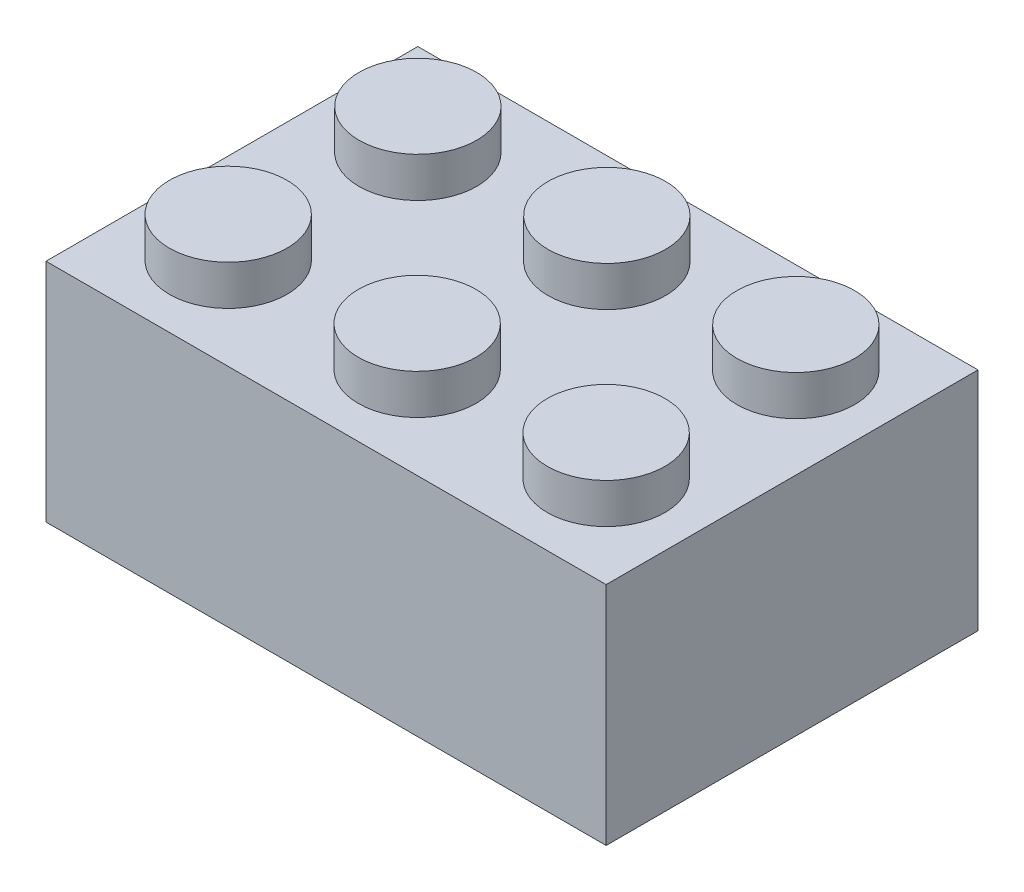
ISO-10303-21;
HEADER;
FILE_DESCRIPTION(('STEP AP214'),'2;1');
FILE_NAME('part.step','',(''),(''),'','','');
FILE_SCHEMA(('AUTOMOTIVE_DESIGN { 1 0 10303 214 1 1 1 1 }'));
ENDSEC;
DATA;
#1=APPLICATION_CONTEXT('core data for automotive mechanical design processes');
#2=APPLICATION_PROTOCOL_DEFINITION('international standard','automotive_design',2000,#1);
#3=PRODUCT_CONTEXT('',#1,'mechanical');
#4=PRODUCT('Part','Part','',(#3));
#5=PRODUCT_RELATED_PRODUCT_CATEGORY('part','',(#4));
#6=PRODUCT_DEFINITION_FORMATION('','',#4);
#7=PRODUCT_DEFINITION_CONTEXT('part definition',#1,'design');
#8=PRODUCT_DEFINITION('design','',#6,#7);
#9=PRODUCT_DEFINITION_SHAPE('','',#8);
#10=(LENGTH_UNIT() NAMED_UNIT(*) SI_UNIT(.MILLI.,.METRE.));
#11=(NAMED_UNIT(*) PLANE_ANGLE_UNIT() SI_UNIT($,.RADIAN.));
#12=(NAMED_UNIT(*) SI_UNIT($,.STERADIAN.) SOLID_ANGLE_UNIT());
#13=UNCERTAINTY_MEASURE_WITH_UNIT(LENGTH_MEASURE(1.E-05),#10,'distance_accuracy_value','');
#14=(GEOMETRIC_REPRESENTATION_CONTEXT(3) GLOBAL_UNCERTAINTY_ASSIGNED_CONTEXT((#13)) GLOBAL_UNIT_ASSIGNED_CONTEXT((#10,
#11,#12)) REPRESENTATION_CONTEXT('',''));
#15=CARTESIAN_POINT('',(0.,0.,0.));
#16=DIRECTION('',(0.,0.,1.));
#17=DIRECTION('',(1.,0.,0.));
#18=AXIS2_PLACEMENT_3D('',#15,#16,#17);
#19=CARTESIAN_POINT('',(0.,9.6,-15.8));
#20=DIRECTION('',(0.,0.,-1.));
#21=DIRECTION('',(-1.,0.,0.));
#22=AXIS2_PLACEMENT_3D('',#19,#20,#21);
#23=PLANE('',#22);
#24=DIRECTION('',(1.,0.,0.));
#25=VECTOR('',#24,1.);
#26=CARTESIAN_POINT('',(0.,0.,-15.8));
#27=LINE('',#26,#25);
#28=CARTESIAN_POINT('',(0.,0.,-15.8));
#29=VERTEX_POINT('',#28);
#30=CARTESIAN_POINT('',(23.8,0.,-15.8));
#31=VERTEX_POINT('',#30);
#32=EDGE_CURVE('E102',#29,#31,#27,.T.);
#33=ORIENTED_EDGE('',*,*,#32,.F.);
#34=DIRECTION('',(0.,-1.,0.));
#35=VECTOR('',#34,1.);
#36=CARTESIAN_POINT('',(0.,9.6,-15.8));
#37=LINE('',#36,#35);
#38=CARTESIAN_POINT('',(0.,9.6,-15.8));
#39=VERTEX_POINT('',#38);
#40=EDGE_CURVE('E11',#39,#29,#37,.T.);
#41=ORIENTED_EDGE('',*,*,#40,.F.);
#42=DIRECTION('',(1.,0.,0.));
#43=VECTOR('',#42,1.);
#44=CARTESIAN_POINT('',(0.,9.6,-15.8));
#45=LINE('',#44,#43);
#46=CARTESIAN_POINT('',(23.8,9.6,-15.8));
#47=VERTEX_POINT('',#46);
#48=EDGE_CURVE('E95',#39,#47,#45,.T.);
#49=ORIENTED_EDGE('',*,*,#48,.T.);
#50=DIRECTION('',(0.,-1.,0.));
#51=VECTOR('',#50,1.);
#52=CARTESIAN_POINT('',(23.8,9.6,-15.8));
#53=LINE('',#52,#51);
#54=EDGE_CURVE('E40',#47,#31,#53,.T.);
#55=ORIENTED_EDGE('',*,*,#54,.T.);
#56=EDGE_LOOP('',(#33,#41,#49,#55));
#57=FACE_BOUND('',#56,.T.);
#58=ADVANCED_FACE('F37',(#57),#23,.T.);
#59=CARTESIAN_POINT('',(0.,9.6,0.));
#60=DIRECTION('',(-1.,0.,0.));
#61=DIRECTION('',(0.,0.,1.));
#62=AXIS2_PLACEMENT_3D('',#59,#60,#61);
#63=PLANE('',#62);
#64=DIRECTION('',(0.,0.,-1.));
#65=VECTOR('',#64,1.);
#66=CARTESIAN_POINT('',(0.,0.,0.));
#67=LINE('',#66,#65);
#68=CARTESIAN_POINT('',(0.,0.,0.));
#69=VERTEX_POINT('',#68);
#70=EDGE_CURVE('E97',#69,#29,#67,.T.);
#71=ORIENTED_EDGE('',*,*,#70,.F.);
#72=DIRECTION('',(0.,-1.,0.));
#73=VECTOR('',#72,1.);
#74=CARTESIAN_POINT('',(0.,9.6,0.));
#75=LINE('',#74,#73);
#76=CARTESIAN_POINT('',(0.,9.6,0.));
#77=VERTEX_POINT('',#76);
#78=EDGE_CURVE('E46',#77,#69,#75,.T.);
#79=ORIENTED_EDGE('',*,*,#78,.F.);
#80=DIRECTION('',(0.,0.,-1.));
#81=VECTOR('',#80,1.);
#82=CARTESIAN_POINT('',(0.,9.6,0.));
#83=LINE('',#82,#81);
#84=EDGE_CURVE('E85',#77,#39,#83,.T.);
#85=ORIENTED_EDGE('',*,*,#84,.T.);
#86=ORIENTED_EDGE('',*,*,#40,.T.);
#87=EDGE_LOOP('',(#71,#79,#85,#86));
#88=FACE_BOUND('',#87,.T.);
#89=ADVANCED_FACE('F113',(#88),#63,.T.);
#90=CARTESIAN_POINT('',(0.,9.6,0.));
#91=DIRECTION('',(0.,0.,-1.));
#92=DIRECTION('',(-1.,0.,0.));
#93=AXIS2_PLACEMENT_3D('',#90,#91,#92);
#94=PLANE('',#93);
#95=DIRECTION('',(1.,0.,0.));
#96=VECTOR('',#95,1.);
#97=CARTESIAN_POINT('',(0.,0.,0.));
#98=LINE('',#97,#96);
#99=CARTESIAN_POINT('',(23.8,0.,0.));
#100=VERTEX_POINT('',#99);
#101=EDGE_CURVE('E90',#69,#100,#98,.T.);
#102=ORIENTED_EDGE('',*,*,#101,.T.);
#103=DIRECTION('',(0.,-1.,0.));
#104=VECTOR('',#103,1.);
#105=CARTESIAN_POINT('',(23.8,9.6,0.));
#106=LINE('',#105,#104);
#107=CARTESIAN_POINT('',(23.8,9.6,0.));
#108=VERTEX_POINT('',#107);
#109=EDGE_CURVE('E88',#108,#100,#106,.T.);
#110=ORIENTED_EDGE('',*,*,#109,.F.);
#111=DIRECTION('',(1.,0.,0.));
#112=VECTOR('',#111,1.);
#113=CARTESIAN_POINT('',(0.,9.6,0.));
#114=LINE('',#113,#112);
#115=EDGE_CURVE('E82',#77,#108,#114,.T.);
#116=ORIENTED_EDGE('',*,*,#115,.F.);
#117=ORIENTED_EDGE('',*,*,#78,.T.);
#118=EDGE_LOOP('',(#102,#110,#116,#117));
#119=FACE_BOUND('',#118,.T.);
#120=ADVANCED_FACE('F89',(#119),#94,.F.);
#121=CARTESIAN_POINT('',(23.8,9.6,0.));
#122=DIRECTION('',(-1.,0.,0.));
#123=DIRECTION('',(0.,0.,1.));
#124=AXIS2_PLACEMENT_3D('',#121,#122,#123);
#125=PLANE('',#124);
#126=DIRECTION('',(0.,0.,-1.));
#127=VECTOR('',#126,1.);
#128=CARTESIAN_POINT('',(23.8,0.,0.));
#129=LINE('',#128,#127);
#130=EDGE_CURVE('E105',#100,#31,#129,.T.);
#131=ORIENTED_EDGE('',*,*,#130,.T.);
#132=ORIENTED_EDGE('',*,*,#54,.F.);
#133=DIRECTION('',(0.,0.,-1.));
#134=VECTOR('',#133,1.);
#135=CARTESIAN_POINT('',(23.8,9.6,0.));
#136=LINE('',#135,#134);
#137=EDGE_CURVE('E79',#108,#47,#136,.T.);
#138=ORIENTED_EDGE('',*,*,#137,.F.);
#139=ORIENTED_EDGE('',*,*,#109,.T.);
#140=EDGE_LOOP('',(#131,#132,#138,#139));
#141=FACE_BOUND('',#140,.T.);
#142=ADVANCED_FACE('F94',(#141),#125,.F.);
#143=CARTESIAN_POINT('',(0.,9.6,0.));
#144=DIRECTION('',(0.,1.,0.));
#145=DIRECTION('',(0.,0.,1.));
#146=AXIS2_PLACEMENT_3D('',#143,#144,#145);
#147=PLANE('',#146);
#148=CARTESIAN_POINT('',(3.841707201316,9.6,-3.9));
#149=DIRECTION('',(0.,1.,0.));
#150=DIRECTION('',(0.,0.,1.));
#151=AXIS2_PLACEMENT_3D('',#148,#149,#150);
#152=CIRCLE('',#151,2.5);
#153=CARTESIAN_POINT('',(3.841707201316,9.6,-1.4));
#154=VERTEX_POINT('',#153);
#155=EDGE_CURVE('E269',#154,#154,#152,.T.);
#156=ORIENTED_EDGE('',*,*,#155,.F.);
#157=EDGE_LOOP('',(#156));
#158=FACE_BOUND('',#157,.T.);
#159=CARTESIAN_POINT('',(19.9000000000001,9.6,-3.9));
#160=DIRECTION('',(0.,1.,0.));
#161=DIRECTION('',(0.,0.,1.));
#162=AXIS2_PLACEMENT_3D('',#159,#160,#161);
#163=CIRCLE('',#162,2.5);
#164=CARTESIAN_POINT('',(19.9000000000001,9.6,-1.4));
#165=VERTEX_POINT('',#164);
#166=EDGE_CURVE('E274',#165,#165,#163,.T.);
#167=ORIENTED_EDGE('',*,*,#166,.F.);
#168=EDGE_LOOP('',(#167));
#169=FACE_BOUND('',#168,.T.);
#170=CARTESIAN_POINT('',(11.870853600658,9.6,-3.9));
#171=DIRECTION('',(0.,1.,0.));
#172=DIRECTION('',(0.,0.,1.));
#173=AXIS2_PLACEMENT_3D('',#170,#171,#172);
#174=CIRCLE('',#173,2.5);
#175=CARTESIAN_POINT('',(11.870853600658,9.6,-1.4));
#176=VERTEX_POINT('',#175);
#177=EDGE_CURVE('E280',#176,#176,#174,.T.);
#178=ORIENTED_EDGE('',*,*,#177,.F.);
#179=EDGE_LOOP('',(#178));
#180=FACE_BOUND('',#179,.T.);
#181=CARTESIAN_POINT('',(19.9582927986841,9.6,-11.9));
#182=DIRECTION('',(0.,1.,0.));
#183=DIRECTION('',(0.,0.,1.));
#184=AXIS2_PLACEMENT_3D('',#181,#182,#183);
#185=CIRCLE('',#184,2.5);
#186=CARTESIAN_POINT('',(19.9582927986841,9.6,-9.4));
#187=VERTEX_POINT('',#186);
#188=EDGE_CURVE('E286',#187,#187,#185,.T.);
#189=ORIENTED_EDGE('',*,*,#188,.F.);
#190=EDGE_LOOP('',(#189));
#191=FACE_BOUND('',#190,.T.);
#192=CARTESIAN_POINT('',(11.929146399342,9.6,-11.9));
#193=DIRECTION('',(0.,1.,0.));
#194=DIRECTION('',(0.,0.,1.));
#195=AXIS2_PLACEMENT_3D('',#192,#193,#194);
#196=CIRCLE('',#195,2.5);
#197=CARTESIAN_POINT('',(11.929146399342,9.6,-9.4));
#198=VERTEX_POINT('',#197);
#199=EDGE_CURVE('E292',#198,#198,#196,.T.);
#200=ORIENTED_EDGE('',*,*,#199,.F.);
#201=EDGE_LOOP('',(#200));
#202=FACE_BOUND('',#201,.T.);
#203=CARTESIAN_POINT('',(3.9,9.6,-11.9));
#204=DIRECTION('',(0.,1.,0.));
#205=DIRECTION('',(0.,0.,1.));
#206=AXIS2_PLACEMENT_3D('',#203,#204,#205);
#207=CIRCLE('',#206,2.5);
#208=CARTESIAN_POINT('',(3.9,9.6,-9.4));
#209=VERTEX_POINT('',#208);
#210=EDGE_CURVE('E298',#209,#209,#207,.T.);
#211=ORIENTED_EDGE('',*,*,#210,.F.);
#212=EDGE_LOOP('',(#211));
#213=FACE_BOUND('',#212,.T.);
#214=ORIENTED_EDGE('',*,*,#48,.F.);
#215=ORIENTED_EDGE('',*,*,#84,.F.);
#216=ORIENTED_EDGE('',*,*,#115,.T.);
#217=ORIENTED_EDGE('',*,*,#137,.T.);
#218=EDGE_LOOP('',(#214,#215,#216,#217));
#219=FACE_BOUND('',#218,.T.);
#220=ADVANCED_FACE('F84',(#158,#169,#180,#191,#202,#213,#219),#147,.T.);
#221=CARTESIAN_POINT('',(0.,0.,0.));
#222=DIRECTION('',(0.,1.,0.));
#223=DIRECTION('',(0.,0.,1.));
#224=AXIS2_PLACEMENT_3D('',#221,#222,#223);
#225=PLANE('',#224);
#226=CARTESIAN_POINT('',(3.90000000000008,0.,-11.9));
#227=DIRECTION('',(0.,-1.,0.));
#228=DIRECTION('',(0.,0.,-1.));
#229=AXIS2_PLACEMENT_3D('',#226,#227,#228);
#230=CIRCLE('',#229,2.6);
#231=CARTESIAN_POINT('',(3.90000000000008,0.,-14.5));
#232=VERTEX_POINT('',#231);
#233=EDGE_CURVE('E265',#232,#232,#230,.T.);
#234=ORIENTED_EDGE('',*,*,#233,.F.);
#235=EDGE_LOOP('',(#234));
#236=FACE_BOUND('',#235,.T.);
#237=CARTESIAN_POINT('',(19.9000000000001,0.,-11.9));
#238=DIRECTION('',(0.,-1.,0.));
#239=DIRECTION('',(0.,0.,-1.));
#240=AXIS2_PLACEMENT_3D('',#237,#238,#239);
#241=CIRCLE('',#240,2.6);
#242=CARTESIAN_POINT('',(19.9000000000001,0.,-14.5));
#243=VERTEX_POINT('',#242);
#244=EDGE_CURVE('E259',#243,#243,#241,.T.);
#245=ORIENTED_EDGE('',*,*,#244,.F.);
#246=EDGE_LOOP('',(#245));
#247=FACE_BOUND('',#246,.T.);
#248=CARTESIAN_POINT('',(11.9000000000001,0.,-11.9));
#249=DIRECTION('',(0.,-1.,0.));
#250=DIRECTION('',(0.,0.,-1.));
#251=AXIS2_PLACEMENT_3D('',#248,#249,#250);
#252=CIRCLE('',#251,2.6);
#253=CARTESIAN_POINT('',(11.9000000000001,0.,-14.5));
#254=VERTEX_POINT('',#253);
#255=EDGE_CURVE('E253',#254,#254,#252,.T.);
#256=ORIENTED_EDGE('',*,*,#255,.F.);
#257=EDGE_LOOP('',(#256));
#258=FACE_BOUND('',#257,.T.);
#259=CARTESIAN_POINT('',(19.9,0.,-3.9));
#260=DIRECTION('',(0.,-1.,0.));
#261=DIRECTION('',(0.,0.,-1.));
#262=AXIS2_PLACEMENT_3D('',#259,#260,#261);
#263=CIRCLE('',#262,2.6);
#264=CARTESIAN_POINT('',(19.9,0.,-6.5));
#265=VERTEX_POINT('',#264);
#266=EDGE_CURVE('E247',#265,#265,#263,.T.);
#267=ORIENTED_EDGE('',*,*,#266,.F.);
#268=EDGE_LOOP('',(#267));
#269=FACE_BOUND('',#268,.T.);
#270=CARTESIAN_POINT('',(11.9,0.,-3.9));
#271=DIRECTION('',(0.,-1.,0.));
#272=DIRECTION('',(0.,0.,-1.));
#273=AXIS2_PLACEMENT_3D('',#270,#271,#272);
#274=CIRCLE('',#273,2.6);
#275=CARTESIAN_POINT('',(11.9,0.,-6.5));
#276=VERTEX_POINT('',#275);
#277=EDGE_CURVE('E236',#276,#276,#274,.T.);
#278=ORIENTED_EDGE('',*,*,#277,.F.);
#279=EDGE_LOOP('',(#278));
#280=FACE_BOUND('',#279,.T.);
#281=CARTESIAN_POINT('',(3.9,0.,-3.9));
#282=DIRECTION('',(0.,-1.,0.));
#283=DIRECTION('',(0.,0.,-1.));
#284=AXIS2_PLACEMENT_3D('',#281,#282,#283);
#285=CIRCLE('',#284,2.6);
#286=CARTESIAN_POINT('',(3.9,0.,-6.5));
#287=VERTEX_POINT('',#286);
#288=EDGE_CURVE('E235',#287,#287,#285,.T.);
#289=ORIENTED_EDGE('',*,*,#288,.F.);
#290=EDGE_LOOP('',(#289));
#291=FACE_BOUND('',#290,.T.);
#292=ORIENTED_EDGE('',*,*,#32,.T.);
#293=ORIENTED_EDGE('',*,*,#130,.F.);
#294=ORIENTED_EDGE('',*,*,#101,.F.);
#295=ORIENTED_EDGE('',*,*,#70,.T.);
#296=EDGE_LOOP('',(#292,#293,#294,#295));
#297=FACE_BOUND('',#296,.T.);
#298=ADVANCED_FACE('F112',(#236,#247,#258,#269,#280,#291,#297),#225,.F.);
#299=CARTESIAN_POINT('',(3.9,11.3,-11.9));
#300=DIRECTION('',(0.,-1.,0.));
#301=DIRECTION('',(0.,0.,-1.));
#302=AXIS2_PLACEMENT_3D('',#299,#300,#301);
#303=CYLINDRICAL_SURFACE('',#302,2.5);
#304=CARTESIAN_POINT('',(3.9,11.3,-11.9));
#305=DIRECTION('',(0.,1.,0.));
#306=DIRECTION('',(0.,0.,1.));
#307=AXIS2_PLACEMENT_3D('',#304,#305,#306);
#308=CIRCLE('',#307,2.5);
#309=CARTESIAN_POINT('',(3.9,11.3,-9.4));
#310=VERTEX_POINT('',#309);
#311=EDGE_CURVE('E106',#310,#310,#308,.T.);
#312=ORIENTED_EDGE('',*,*,#311,.F.);
#313=EDGE_LOOP('',(#312));
#314=FACE_BOUND('',#313,.T.);
#315=ORIENTED_EDGE('',*,*,#210,.T.);
#316=EDGE_LOOP('',(#315));
#317=FACE_BOUND('',#316,.T.);
#318=ADVANCED_FACE('F131',(#314,#317),#303,.T.);
#319=CARTESIAN_POINT('',(3.9,11.3,-11.9));
#320=DIRECTION('',(0.,1.,0.));
#321=DIRECTION('',(0.,0.,1.));
#322=AXIS2_PLACEMENT_3D('',#319,#320,#321);
#323=PLANE('',#322);
#324=ORIENTED_EDGE('',*,*,#311,.T.);
#325=EDGE_LOOP('',(#324));
#326=FACE_BOUND('',#325,.T.);
#327=ADVANCED_FACE('F138',(#326),#323,.T.);
#328=CARTESIAN_POINT('',(11.929146399342,11.3,-11.9));
#329=DIRECTION('',(0.,-1.,0.));
#330=DIRECTION('',(0.,0.,-1.));
#331=AXIS2_PLACEMENT_3D('',#328,#329,#330);
#332=CYLINDRICAL_SURFACE('',#331,2.5);
#333=CARTESIAN_POINT('',(11.929146399342,11.3,-11.9));
#334=DIRECTION('',(0.,1.,0.));
#335=DIRECTION('',(0.,0.,1.));
#336=AXIS2_PLACEMENT_3D('',#333,#334,#335);
#337=CIRCLE('',#336,2.5);
#338=CARTESIAN_POINT('',(11.929146399342,11.3,-9.4));
#339=VERTEX_POINT('',#338);
#340=EDGE_CURVE('E295',#339,#339,#337,.T.);
#341=ORIENTED_EDGE('',*,*,#340,.F.);
#342=EDGE_LOOP('',(#341));
#343=FACE_BOUND('',#342,.T.);
#344=ORIENTED_EDGE('',*,*,#199,.T.);
#345=EDGE_LOOP('',(#344));
#346=FACE_BOUND('',#345,.T.);
#347=ADVANCED_FACE('F142',(#343,#346),#332,.T.);
#348=CARTESIAN_POINT('',(11.929146399342,11.3,-11.9));
#349=DIRECTION('',(0.,1.,0.));
#350=DIRECTION('',(0.,0.,1.));
#351=AXIS2_PLACEMENT_3D('',#348,#349,#350);
#352=PLANE('',#351);
#353=ORIENTED_EDGE('',*,*,#340,.T.);
#354=EDGE_LOOP('',(#353));
#355=FACE_BOUND('',#354,.T.);
#356=ADVANCED_FACE('F146',(#355),#352,.T.);
#357=CARTESIAN_POINT('',(19.9582927986841,11.3,-11.9));
#358=DIRECTION('',(0.,-1.,0.));
#359=DIRECTION('',(0.,0.,-1.));
#360=AXIS2_PLACEMENT_3D('',#357,#358,#359);
#361=CYLINDRICAL_SURFACE('',#360,2.5);
#362=CARTESIAN_POINT('',(19.9582927986841,11.3,-11.9));
#363=DIRECTION('',(0.,1.,0.));
#364=DIRECTION('',(0.,0.,1.));
#365=AXIS2_PLACEMENT_3D('',#362,#363,#364);
#366=CIRCLE('',#365,2.5);
#367=CARTESIAN_POINT('',(19.9582927986841,11.3,-9.4));
#368=VERTEX_POINT('',#367);
#369=EDGE_CURVE('E289',#368,#368,#366,.T.);
#370=ORIENTED_EDGE('',*,*,#369,.F.);
#371=EDGE_LOOP('',(#370));
#372=FACE_BOUND('',#371,.T.);
#373=ORIENTED_EDGE('',*,*,#188,.T.);
#374=EDGE_LOOP('',(#373));
#375=FACE_BOUND('',#374,.T.);
#376=ADVANCED_FACE('F150',(#372,#375),#361,.T.);
#377=CARTESIAN_POINT('',(19.9582927986841,11.3,-11.9));
#378=DIRECTION('',(0.,1.,0.));
#379=DIRECTION('',(0.,0.,1.));
#380=AXIS2_PLACEMENT_3D('',#377,#378,#379);
#381=PLANE('',#380);
#382=ORIENTED_EDGE('',*,*,#369,.T.);
#383=EDGE_LOOP('',(#382));
#384=FACE_BOUND('',#383,.T.);
#385=ADVANCED_FACE('F154',(#384),#381,.T.);
#386=CARTESIAN_POINT('',(11.870853600658,11.3,-3.9));
#387=DIRECTION('',(0.,-1.,0.));
#388=DIRECTION('',(0.,0.,-1.));
#389=AXIS2_PLACEMENT_3D('',#386,#387,#388);
#390=CYLINDRICAL_SURFACE('',#389,2.5);
#391=CARTESIAN_POINT('',(11.870853600658,11.3,-3.9));
#392=DIRECTION('',(0.,1.,0.));
#393=DIRECTION('',(0.,0.,1.));
#394=AXIS2_PLACEMENT_3D('',#391,#392,#393);
#395=CIRCLE('',#394,2.5);
#396=CARTESIAN_POINT('',(11.870853600658,11.3,-1.4));
#397=VERTEX_POINT('',#396);
#398=EDGE_CURVE('E283',#397,#397,#395,.T.);
#399=ORIENTED_EDGE('',*,*,#398,.F.);
#400=EDGE_LOOP('',(#399));
#401=FACE_BOUND('',#400,.T.);
#402=ORIENTED_EDGE('',*,*,#177,.T.);
#403=EDGE_LOOP('',(#402));
#404=FACE_BOUND('',#403,.T.);
#405=ADVANCED_FACE('F158',(#401,#404),#390,.T.);
#406=CARTESIAN_POINT('',(11.870853600658,11.3,-3.9));
#407=DIRECTION('',(0.,1.,0.));
#408=DIRECTION('',(0.,0.,1.));
#409=AXIS2_PLACEMENT_3D('',#406,#407,#408);
#410=PLANE('',#409);
#411=ORIENTED_EDGE('',*,*,#398,.T.);
#412=EDGE_LOOP('',(#411));
#413=FACE_BOUND('',#412,.T.);
#414=ADVANCED_FACE('F162',(#413),#410,.T.);
#415=CARTESIAN_POINT('',(19.9000000000001,11.3,-3.9));
#416=DIRECTION('',(0.,-1.,0.));
#417=DIRECTION('',(0.,0.,-1.));
#418=AXIS2_PLACEMENT_3D('',#415,#416,#417);
#419=CYLINDRICAL_SURFACE('',#418,2.5);
#420=CARTESIAN_POINT('',(19.9000000000001,11.3,-3.9));
#421=DIRECTION('',(0.,1.,0.));
#422=DIRECTION('',(0.,0.,1.));
#423=AXIS2_PLACEMENT_3D('',#420,#421,#422);
#424=CIRCLE('',#423,2.5);
#425=CARTESIAN_POINT('',(19.9000000000001,11.3,-1.4));
#426=VERTEX_POINT('',#425);
#427=EDGE_CURVE('E277',#426,#426,#424,.T.);
#428=ORIENTED_EDGE('',*,*,#427,.F.);
#429=EDGE_LOOP('',(#428));
#430=FACE_BOUND('',#429,.T.);
#431=ORIENTED_EDGE('',*,*,#166,.T.);
#432=EDGE_LOOP('',(#431));
#433=FACE_BOUND('',#432,.T.);
#434=ADVANCED_FACE('F166',(#430,#433),#419,.T.);
#435=CARTESIAN_POINT('',(19.9000000000001,11.3,-3.9));
#436=DIRECTION('',(0.,1.,0.));
#437=DIRECTION('',(0.,0.,1.));
#438=AXIS2_PLACEMENT_3D('',#435,#436,#437);
#439=PLANE('',#438);
#440=ORIENTED_EDGE('',*,*,#427,.T.);
#441=EDGE_LOOP('',(#440));
#442=FACE_BOUND('',#441,.T.);
#443=ADVANCED_FACE('F170',(#442),#439,.T.);
#444=CARTESIAN_POINT('',(3.841707201316,11.3,-3.9));
#445=DIRECTION('',(0.,-1.,0.));
#446=DIRECTION('',(0.,0.,-1.));
#447=AXIS2_PLACEMENT_3D('',#444,#445,#446);
#448=CYLINDRICAL_SURFACE('',#447,2.5);
#449=CARTESIAN_POINT('',(3.841707201316,11.3,-3.9));
#450=DIRECTION('',(0.,1.,0.));
#451=DIRECTION('',(0.,0.,1.));
#452=AXIS2_PLACEMENT_3D('',#449,#450,#451);
#453=CIRCLE('',#452,2.5);
#454=CARTESIAN_POINT('',(3.841707201316,11.3,-1.4));
#455=VERTEX_POINT('',#454);
#456=EDGE_CURVE('E271',#455,#455,#453,.T.);
#457=ORIENTED_EDGE('',*,*,#456,.F.);
#458=EDGE_LOOP('',(#457));
#459=FACE_BOUND('',#458,.T.);
#460=ORIENTED_EDGE('',*,*,#155,.T.);
#461=EDGE_LOOP('',(#460));
#462=FACE_BOUND('',#461,.T.);
#463=ADVANCED_FACE('F174',(#459,#462),#448,.T.);
#464=CARTESIAN_POINT('',(3.841707201316,11.3,-3.9));
#465=DIRECTION('',(0.,1.,0.));
#466=DIRECTION('',(0.,0.,1.));
#467=AXIS2_PLACEMENT_3D('',#464,#465,#466);
#468=PLANE('',#467);
#469=ORIENTED_EDGE('',*,*,#456,.T.);
#470=EDGE_LOOP('',(#469));
#471=FACE_BOUND('',#470,.T.);
#472=ADVANCED_FACE('F178',(#471),#468,.T.);
#473=CARTESIAN_POINT('',(3.9,1.8,-3.9));
#474=DIRECTION('',(0.,-1.,0.));
#475=DIRECTION('',(0.,0.,-1.));
#476=AXIS2_PLACEMENT_3D('',#473,#474,#475);
#477=CYLINDRICAL_SURFACE('',#476,2.6);
#478=CARTESIAN_POINT('',(3.9,1.8,-3.9));
#479=DIRECTION('',(0.,-1.,0.));
#480=DIRECTION('',(0.,0.,-1.));
#481=AXIS2_PLACEMENT_3D('',#478,#479,#480);
#482=CIRCLE('',#481,2.6);
#483=CARTESIAN_POINT('',(3.9,1.8,-6.5));
#484=VERTEX_POINT('',#483);
#485=EDGE_CURVE('E239',#484,#484,#482,.T.);
#486=ORIENTED_EDGE('',*,*,#485,.F.);
#487=EDGE_LOOP('',(#486));
#488=FACE_BOUND('',#487,.T.);
#489=ORIENTED_EDGE('',*,*,#288,.T.);
#490=EDGE_LOOP('',(#489));
#491=FACE_BOUND('',#490,.T.);
#492=ADVANCED_FACE('F182',(#488,#491),#477,.F.);
#493=CARTESIAN_POINT('',(3.9,1.8,-3.9));
#494=DIRECTION('',(0.,-1.,0.));
#495=DIRECTION('',(0.,0.,-1.));
#496=AXIS2_PLACEMENT_3D('',#493,#494,#495);
#497=PLANE('',#496);
#498=ORIENTED_EDGE('',*,*,#485,.T.);
#499=EDGE_LOOP('',(#498));
#500=FACE_BOUND('',#499,.T.);
#501=ADVANCED_FACE('F186',(#500),#497,.T.);
#502=CARTESIAN_POINT('',(11.9,1.8,-3.9));
#503=DIRECTION('',(0.,-1.,0.));
#504=DIRECTION('',(0.,0.,-1.));
#505=AXIS2_PLACEMENT_3D('',#502,#503,#504);
#506=CYLINDRICAL_SURFACE('',#505,2.6);
#507=CARTESIAN_POINT('',(11.9,1.8,-3.9));
#508=DIRECTION('',(0.,-1.,0.));
#509=DIRECTION('',(0.,0.,-1.));
#510=AXIS2_PLACEMENT_3D('',#507,#508,#509);
#511=CIRCLE('',#510,2.6);
#512=CARTESIAN_POINT('',(11.9,1.8,-6.5));
#513=VERTEX_POINT('',#512);
#514=EDGE_CURVE('E234',#513,#513,#511,.T.);
#515=ORIENTED_EDGE('',*,*,#514,.F.);
#516=EDGE_LOOP('',(#515));
#517=FACE_BOUND('',#516,.T.);
#518=ORIENTED_EDGE('',*,*,#277,.T.);
#519=EDGE_LOOP('',(#518));
#520=FACE_BOUND('',#519,.T.);
#521=ADVANCED_FACE('F190',(#517,#520),#506,.F.);
#522=CARTESIAN_POINT('',(11.9,1.8,-3.9));
#523=DIRECTION('',(0.,-1.,0.));
#524=DIRECTION('',(0.,0.,-1.));
#525=AXIS2_PLACEMENT_3D('',#522,#523,#524);
#526=PLANE('',#525);
#527=ORIENTED_EDGE('',*,*,#514,.T.);
#528=EDGE_LOOP('',(#527));
#529=FACE_BOUND('',#528,.T.);
#530=ADVANCED_FACE('F220',(#529),#526,.T.);
#531=CARTESIAN_POINT('',(19.9,1.8,-3.9));
#532=DIRECTION('',(0.,-1.,0.));
#533=DIRECTION('',(0.,0.,-1.));
#534=AXIS2_PLACEMENT_3D('',#531,#532,#533);
#535=CYLINDRICAL_SURFACE('',#534,2.6);
#536=CARTESIAN_POINT('',(19.9,1.8,-3.9));
#537=DIRECTION('',(0.,-1.,0.));
#538=DIRECTION('',(0.,0.,-1.));
#539=AXIS2_PLACEMENT_3D('',#536,#537,#538);
#540=CIRCLE('',#539,2.6);
#541=CARTESIAN_POINT('',(19.9,1.8,-6.5));
#542=VERTEX_POINT('',#541);
#543=EDGE_CURVE('E242',#542,#542,#540,.T.);
#544=ORIENTED_EDGE('',*,*,#543,.F.);
#545=EDGE_LOOP('',(#544));
#546=FACE_BOUND('',#545,.T.);
#547=ORIENTED_EDGE('',*,*,#266,.T.);
#548=EDGE_LOOP('',(#547));
#549=FACE_BOUND('',#548,.T.);
#550=ADVANCED_FACE('F217',(#546,#549),#535,.F.);
#551=CARTESIAN_POINT('',(19.9,1.8,-3.9));
#552=DIRECTION('',(0.,-1.,0.));
#553=DIRECTION('',(0.,0.,-1.));
#554=AXIS2_PLACEMENT_3D('',#551,#552,#553);
#555=PLANE('',#554);
#556=ORIENTED_EDGE('',*,*,#543,.T.);
#557=EDGE_LOOP('',(#556));
#558=FACE_BOUND('',#557,.T.);
#559=ADVANCED_FACE('F212',(#558),#555,.T.);
#560=CARTESIAN_POINT('',(11.9000000000001,1.8,-11.9));
#561=DIRECTION('',(0.,-1.,0.));
#562=DIRECTION('',(0.,0.,-1.));
#563=AXIS2_PLACEMENT_3D('',#560,#561,#562);
#564=CYLINDRICAL_SURFACE('',#563,2.6);
#565=CARTESIAN_POINT('',(11.9000000000001,1.8,-11.9));
#566=DIRECTION('',(0.,-1.,0.));
#567=DIRECTION('',(0.,0.,-1.));
#568=AXIS2_PLACEMENT_3D('',#565,#566,#567);
#569=CIRCLE('',#568,2.6);
#570=CARTESIAN_POINT('',(11.9000000000001,1.8,-14.5));
#571=VERTEX_POINT('',#570);
#572=EDGE_CURVE('E250',#571,#571,#569,.T.);
#573=ORIENTED_EDGE('',*,*,#572,.F.);
#574=EDGE_LOOP('',(#573));
#575=FACE_BOUND('',#574,.T.);
#576=ORIENTED_EDGE('',*,*,#255,.T.);
#577=EDGE_LOOP('',(#576));
#578=FACE_BOUND('',#577,.T.);
#579=ADVANCED_FACE('F209',(#575,#578),#564,.F.);
#580=CARTESIAN_POINT('',(11.9000000000001,1.8,-11.9));
#581=DIRECTION('',(0.,-1.,0.));
#582=DIRECTION('',(0.,0.,-1.));
#583=AXIS2_PLACEMENT_3D('',#580,#581,#582);
#584=PLANE('',#583);
#585=ORIENTED_EDGE('',*,*,#572,.T.);
#586=EDGE_LOOP('',(#585));
#587=FACE_BOUND('',#586,.T.);
#588=ADVANCED_FACE('F204',(#587),#584,.T.);
#589=CARTESIAN_POINT('',(19.9000000000001,1.8,-11.9));
#590=DIRECTION('',(0.,-1.,0.));
#591=DIRECTION('',(0.,0.,-1.));
#592=AXIS2_PLACEMENT_3D('',#589,#590,#591);
#593=CYLINDRICAL_SURFACE('',#592,2.6);
#594=CARTESIAN_POINT('',(19.9000000000001,1.8,-11.9));
#595=DIRECTION('',(0.,-1.,0.));
#596=DIRECTION('',(0.,0.,-1.));
#597=AXIS2_PLACEMENT_3D('',#594,#595,#596);
#598=CIRCLE('',#597,2.6);
#599=CARTESIAN_POINT('',(19.9000000000001,1.8,-14.5));
#600=VERTEX_POINT('',#599);
#601=EDGE_CURVE('E256',#600,#600,#598,.T.);
#602=ORIENTED_EDGE('',*,*,#601,.F.);
#603=EDGE_LOOP('',(#602));
#604=FACE_BOUND('',#603,.T.);
#605=ORIENTED_EDGE('',*,*,#244,.T.);
#606=EDGE_LOOP('',(#605));
#607=FACE_BOUND('',#606,.T.);
#608=ADVANCED_FACE('F201',(#604,#607),#593,.F.);
#609=CARTESIAN_POINT('',(19.9000000000001,1.8,-11.9));
#610=DIRECTION('',(0.,-1.,0.));
#611=DIRECTION('',(0.,0.,-1.));
#612=AXIS2_PLACEMENT_3D('',#609,#610,#611);
#613=PLANE('',#612);
#614=ORIENTED_EDGE('',*,*,#601,.T.);
#615=EDGE_LOOP('',(#614));
#616=FACE_BOUND('',#615,.T.);
#617=ADVANCED_FACE('F196',(#616),#613,.T.);
#618=CARTESIAN_POINT('',(3.90000000000008,1.8,-11.9));
#619=DIRECTION('',(0.,-1.,0.));
#620=DIRECTION('',(0.,0.,-1.));
#621=AXIS2_PLACEMENT_3D('',#618,#619,#620);
#622=CYLINDRICAL_SURFACE('',#621,2.6);
#623=CARTESIAN_POINT('',(3.90000000000008,1.8,-11.9));
#624=DIRECTION('',(0.,-1.,0.));
#625=DIRECTION('',(0.,0.,-1.));
#626=AXIS2_PLACEMENT_3D('',#623,#624,#625);
#627=CIRCLE('',#626,2.6);
#628=CARTESIAN_POINT('',(3.90000000000008,1.8,-14.5));
#629=VERTEX_POINT('',#628);
#630=EDGE_CURVE('E262',#629,#629,#627,.T.);
#631=ORIENTED_EDGE('',*,*,#630,.F.);
#632=EDGE_LOOP('',(#631));
#633=FACE_BOUND('',#632,.T.);
#634=ORIENTED_EDGE('',*,*,#233,.T.);
#635=EDGE_LOOP('',(#634));
#636=FACE_BOUND('',#635,.T.);
#637=ADVANCED_FACE('F192',(#633,#636),#622,.F.);
#638=CARTESIAN_POINT('',(3.90000000000008,1.8,-11.9));
#639=DIRECTION('',(0.,-1.,0.));
#640=DIRECTION('',(0.,0.,-1.));
#641=AXIS2_PLACEMENT_3D('',#638,#639,#640);
#642=PLANE('',#641);
#643=ORIENTED_EDGE('',*,*,#630,.T.);
#644=EDGE_LOOP('',(#643));
#645=FACE_BOUND('',#644,.T.);
#646=ADVANCED_FACE('F195',(#645),#642,.T.);
#647=CLOSED_SHELL('',(#58,#89,#120,#142,#220,#298,#318,#327,#347,#356,#376,#385,#405,#414,#434,
#443,#463,#472,#492,#501,#521,#530,#550,#559,#579,#588,#608,#617,#637,#646));
#648=MANIFOLD_SOLID_BREP('B2',#647);
#649=ADVANCED_BREP_SHAPE_REPRESENTATION('',(#18,#648),#14);
#650=SHAPE_DEFINITION_REPRESENTATION(#9,#649);
ENDSEC;
END-ISO-10303-21;
